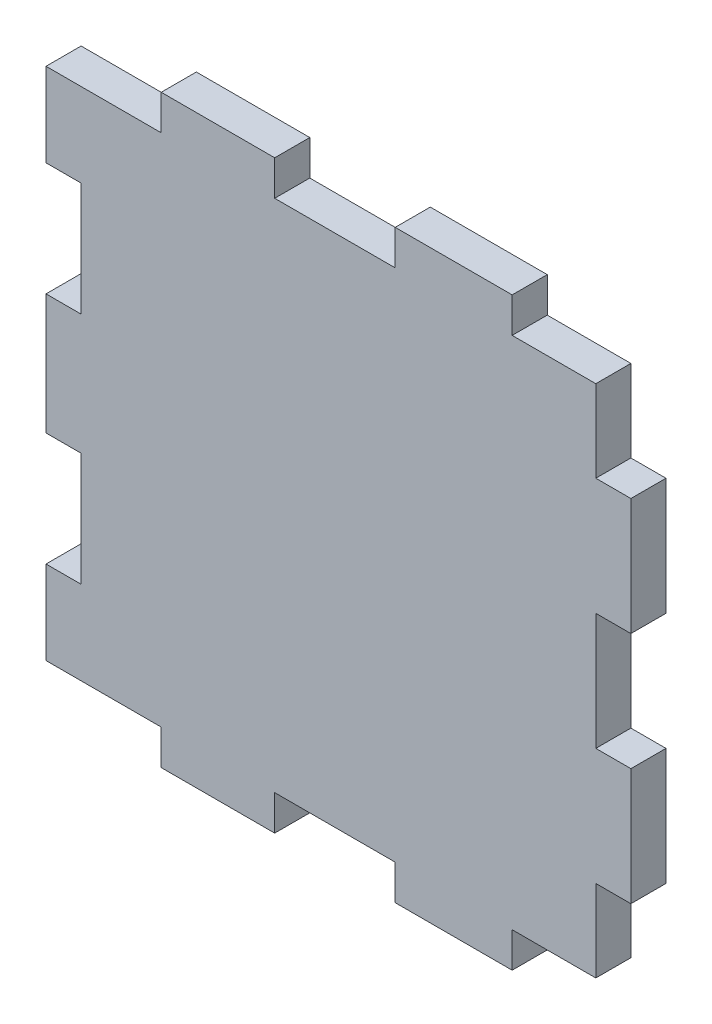
ISO-10303-21;
HEADER;
FILE_DESCRIPTION(('STEP AP214'),'2;1');
FILE_NAME('part.step','',(''),(''),'','','');
FILE_SCHEMA(('AUTOMOTIVE_DESIGN { 1 0 10303 214 1 1 1 1 }'));
ENDSEC;
DATA;
#1=APPLICATION_CONTEXT('core data for automotive mechanical design processes');
#2=APPLICATION_PROTOCOL_DEFINITION('international standard','automotive_design',2000,#1);
#3=PRODUCT_CONTEXT('',#1,'mechanical');
#4=PRODUCT('Part','Part','',(#3));
#5=PRODUCT_RELATED_PRODUCT_CATEGORY('part','',(#4));
#6=PRODUCT_DEFINITION_FORMATION('','',#4);
#7=PRODUCT_DEFINITION_CONTEXT('part definition',#1,'design');
#8=PRODUCT_DEFINITION('design','',#6,#7);
#9=PRODUCT_DEFINITION_SHAPE('','',#8);
#10=(LENGTH_UNIT() NAMED_UNIT(*) SI_UNIT(.MILLI.,.METRE.));
#11=(NAMED_UNIT(*) PLANE_ANGLE_UNIT() SI_UNIT($,.RADIAN.));
#12=(NAMED_UNIT(*) SI_UNIT($,.STERADIAN.) SOLID_ANGLE_UNIT());
#13=UNCERTAINTY_MEASURE_WITH_UNIT(LENGTH_MEASURE(1.E-05),#10,'distance_accuracy_value','');
#14=(GEOMETRIC_REPRESENTATION_CONTEXT(3) GLOBAL_UNCERTAINTY_ASSIGNED_CONTEXT((#13)) GLOBAL_UNIT_ASSIGNED_CONTEXT((#10,
#11,#12)) REPRESENTATION_CONTEXT('',''));
#15=CARTESIAN_POINT('',(0.,0.,0.));
#16=DIRECTION('',(0.,0.,1.));
#17=DIRECTION('',(1.,0.,0.));
#18=AXIS2_PLACEMENT_3D('',#15,#16,#17);
#19=CARTESIAN_POINT('',(-26.5,14.85,3.));
#20=DIRECTION('',(1.,0.,0.));
#21=DIRECTION('',(0.,0.,-1.));
#22=AXIS2_PLACEMENT_3D('',#19,#20,#21);
#23=PLANE('',#22);
#24=DIRECTION('',(0.,-1.,0.));
#25=VECTOR('',#24,1.);
#26=CARTESIAN_POINT('',(-26.5,14.85,0.));
#27=LINE('',#26,#25);
#28=CARTESIAN_POINT('',(-26.5,22.,0.));
#29=VERTEX_POINT('',#28);
#30=CARTESIAN_POINT('',(-26.5,14.85,0.));
#31=VERTEX_POINT('',#30);
#32=EDGE_CURVE('E308',#29,#31,#27,.T.);
#33=ORIENTED_EDGE('',*,*,#32,.T.);
#34=DIRECTION('',(0.,0.,-1.));
#35=VECTOR('',#34,1.);
#36=CARTESIAN_POINT('',(-26.5,14.85,3.));
#37=LINE('',#36,#35);
#38=CARTESIAN_POINT('',(-26.5,14.85,3.));
#39=VERTEX_POINT('',#38);
#40=EDGE_CURVE('E11',#39,#31,#37,.T.);
#41=ORIENTED_EDGE('',*,*,#40,.F.);
#42=DIRECTION('',(0.,-1.,0.));
#43=VECTOR('',#42,1.);
#44=CARTESIAN_POINT('',(-26.5,14.85,3.));
#45=LINE('',#44,#43);
#46=CARTESIAN_POINT('',(-26.5,22.,3.));
#47=VERTEX_POINT('',#46);
#48=EDGE_CURVE('E414',#47,#39,#45,.T.);
#49=ORIENTED_EDGE('',*,*,#48,.F.);
#50=DIRECTION('',(0.,0.,-1.));
#51=VECTOR('',#50,1.);
#52=CARTESIAN_POINT('',(-26.5,22.,3.));
#53=LINE('',#52,#51);
#54=EDGE_CURVE('E304',#47,#29,#53,.T.);
#55=ORIENTED_EDGE('',*,*,#54,.T.);
#56=EDGE_LOOP('',(#33,#41,#49,#55));
#57=FACE_BOUND('',#56,.T.);
#58=ADVANCED_FACE('F39',(#57),#23,.F.);
#59=CARTESIAN_POINT('',(-26.5,14.85,3.));
#60=DIRECTION('',(0.,1.,0.));
#61=DIRECTION('',(-1.,0.,0.));
#62=AXIS2_PLACEMENT_3D('',#59,#60,#61);
#63=PLANE('',#62);
#64=DIRECTION('',(1.,0.,0.));
#65=VECTOR('',#64,1.);
#66=CARTESIAN_POINT('',(-26.5,14.85,0.));
#67=LINE('',#66,#65);
#68=CARTESIAN_POINT('',(-23.5,14.85,0.));
#69=VERTEX_POINT('',#68);
#70=EDGE_CURVE('E312',#31,#69,#67,.T.);
#71=ORIENTED_EDGE('',*,*,#70,.T.);
#72=DIRECTION('',(0.,0.,-1.));
#73=VECTOR('',#72,1.);
#74=CARTESIAN_POINT('',(-23.5,14.85,3.));
#75=LINE('',#74,#73);
#76=CARTESIAN_POINT('',(-23.5,14.85,3.));
#77=VERTEX_POINT('',#76);
#78=EDGE_CURVE('E48',#77,#69,#75,.T.);
#79=ORIENTED_EDGE('',*,*,#78,.F.);
#80=DIRECTION('',(1.,0.,0.));
#81=VECTOR('',#80,1.);
#82=CARTESIAN_POINT('',(-26.5,14.85,3.));
#83=LINE('',#82,#81);
#84=EDGE_CURVE('E183',#39,#77,#83,.T.);
#85=ORIENTED_EDGE('',*,*,#84,.F.);
#86=ORIENTED_EDGE('',*,*,#40,.T.);
#87=EDGE_LOOP('',(#71,#79,#85,#86));
#88=FACE_BOUND('',#87,.T.);
#89=ADVANCED_FACE('F676',(#88),#63,.F.);
#90=CARTESIAN_POINT('',(-23.5,14.85,3.));
#91=DIRECTION('',(1.,0.,0.));
#92=DIRECTION('',(0.,0.,-1.));
#93=AXIS2_PLACEMENT_3D('',#90,#91,#92);
#94=PLANE('',#93);
#95=DIRECTION('',(0.,-1.,0.));
#96=VECTOR('',#95,1.);
#97=CARTESIAN_POINT('',(-23.5,14.85,0.));
#98=LINE('',#97,#96);
#99=CARTESIAN_POINT('',(-23.5,5.15,0.));
#100=VERTEX_POINT('',#99);
#101=EDGE_CURVE('E315',#69,#100,#98,.T.);
#102=ORIENTED_EDGE('',*,*,#101,.T.);
#103=DIRECTION('',(0.,0.,-1.));
#104=VECTOR('',#103,1.);
#105=CARTESIAN_POINT('',(-23.5,5.15,3.));
#106=LINE('',#105,#104);
#107=CARTESIAN_POINT('',(-23.5,5.15,3.));
#108=VERTEX_POINT('',#107);
#109=EDGE_CURVE('E537',#108,#100,#106,.T.);
#110=ORIENTED_EDGE('',*,*,#109,.F.);
#111=DIRECTION('',(0.,-1.,0.));
#112=VECTOR('',#111,1.);
#113=CARTESIAN_POINT('',(-23.5,14.85,3.));
#114=LINE('',#113,#112);
#115=EDGE_CURVE('E547',#77,#108,#114,.T.);
#116=ORIENTED_EDGE('',*,*,#115,.F.);
#117=ORIENTED_EDGE('',*,*,#78,.T.);
#118=EDGE_LOOP('',(#102,#110,#116,#117));
#119=FACE_BOUND('',#118,.T.);
#120=ADVANCED_FACE('F545',(#119),#94,.F.);
#121=CARTESIAN_POINT('',(-26.5,5.15,3.));
#122=DIRECTION('',(0.,-1.,0.));
#123=DIRECTION('',(1.,0.,0.));
#124=AXIS2_PLACEMENT_3D('',#121,#122,#123);
#125=PLANE('',#124);
#126=DIRECTION('',(-1.,0.,0.));
#127=VECTOR('',#126,1.);
#128=CARTESIAN_POINT('',(-26.5,5.15,0.));
#129=LINE('',#128,#127);
#130=CARTESIAN_POINT('',(-26.5,5.15,0.));
#131=VERTEX_POINT('',#130);
#132=EDGE_CURVE('E318',#100,#131,#129,.T.);
#133=ORIENTED_EDGE('',*,*,#132,.T.);
#134=DIRECTION('',(0.,0.,-1.));
#135=VECTOR('',#134,1.);
#136=CARTESIAN_POINT('',(-26.5,5.15,3.));
#137=LINE('',#136,#135);
#138=CARTESIAN_POINT('',(-26.5,5.15,3.));
#139=VERTEX_POINT('',#138);
#140=EDGE_CURVE('E533',#139,#131,#137,.T.);
#141=ORIENTED_EDGE('',*,*,#140,.F.);
#142=DIRECTION('',(-1.,0.,0.));
#143=VECTOR('',#142,1.);
#144=CARTESIAN_POINT('',(-26.5,5.15,3.));
#145=LINE('',#144,#143);
#146=EDGE_CURVE('E566',#108,#139,#145,.T.);
#147=ORIENTED_EDGE('',*,*,#146,.F.);
#148=ORIENTED_EDGE('',*,*,#109,.T.);
#149=EDGE_LOOP('',(#133,#141,#147,#148));
#150=FACE_BOUND('',#149,.T.);
#151=ADVANCED_FACE('F556',(#150),#125,.F.);
#152=CARTESIAN_POINT('',(-26.5,-5.15,3.));
#153=DIRECTION('',(1.,0.,0.));
#154=DIRECTION('',(0.,0.,-1.));
#155=AXIS2_PLACEMENT_3D('',#152,#153,#154);
#156=PLANE('',#155);
#157=DIRECTION('',(0.,-1.,0.));
#158=VECTOR('',#157,1.);
#159=CARTESIAN_POINT('',(-26.5,-5.15,0.));
#160=LINE('',#159,#158);
#161=CARTESIAN_POINT('',(-26.5,-5.15,0.));
#162=VERTEX_POINT('',#161);
#163=EDGE_CURVE('E321',#131,#162,#160,.T.);
#164=ORIENTED_EDGE('',*,*,#163,.T.);
#165=DIRECTION('',(0.,0.,-1.));
#166=VECTOR('',#165,1.);
#167=CARTESIAN_POINT('',(-26.5,-5.15,3.));
#168=LINE('',#167,#166);
#169=CARTESIAN_POINT('',(-26.5,-5.15,3.));
#170=VERTEX_POINT('',#169);
#171=EDGE_CURVE('E529',#170,#162,#168,.T.);
#172=ORIENTED_EDGE('',*,*,#171,.F.);
#173=DIRECTION('',(0.,-1.,0.));
#174=VECTOR('',#173,1.);
#175=CARTESIAN_POINT('',(-26.5,-5.15,3.));
#176=LINE('',#175,#174);
#177=EDGE_CURVE('E562',#139,#170,#176,.T.);
#178=ORIENTED_EDGE('',*,*,#177,.F.);
#179=ORIENTED_EDGE('',*,*,#140,.T.);
#180=EDGE_LOOP('',(#164,#172,#178,#179));
#181=FACE_BOUND('',#180,.T.);
#182=ADVANCED_FACE('F560',(#181),#156,.F.);
#183=CARTESIAN_POINT('',(-26.5,-5.15,3.));
#184=DIRECTION('',(0.,1.,0.));
#185=DIRECTION('',(-1.,0.,0.));
#186=AXIS2_PLACEMENT_3D('',#183,#184,#185);
#187=PLANE('',#186);
#188=DIRECTION('',(1.,0.,0.));
#189=VECTOR('',#188,1.);
#190=CARTESIAN_POINT('',(-26.5,-5.15,0.));
#191=LINE('',#190,#189);
#192=CARTESIAN_POINT('',(-23.5,-5.15,0.));
#193=VERTEX_POINT('',#192);
#194=EDGE_CURVE('E324',#162,#193,#191,.T.);
#195=ORIENTED_EDGE('',*,*,#194,.T.);
#196=DIRECTION('',(0.,0.,-1.));
#197=VECTOR('',#196,1.);
#198=CARTESIAN_POINT('',(-23.5,-5.15,3.));
#199=LINE('',#198,#197);
#200=CARTESIAN_POINT('',(-23.5,-5.15,3.));
#201=VERTEX_POINT('',#200);
#202=EDGE_CURVE('E525',#201,#193,#199,.T.);
#203=ORIENTED_EDGE('',*,*,#202,.F.);
#204=DIRECTION('',(1.,0.,0.));
#205=VECTOR('',#204,1.);
#206=CARTESIAN_POINT('',(-26.5,-5.15,3.));
#207=LINE('',#206,#205);
#208=EDGE_CURVE('E565',#170,#201,#207,.T.);
#209=ORIENTED_EDGE('',*,*,#208,.F.);
#210=ORIENTED_EDGE('',*,*,#171,.T.);
#211=EDGE_LOOP('',(#195,#203,#209,#210));
#212=FACE_BOUND('',#211,.T.);
#213=ADVANCED_FACE('F689',(#212),#187,.F.);
#214=CARTESIAN_POINT('',(-23.5,-14.85,3.));
#215=DIRECTION('',(1.,0.,0.));
#216=DIRECTION('',(0.,0.,-1.));
#217=AXIS2_PLACEMENT_3D('',#214,#215,#216);
#218=PLANE('',#217);
#219=DIRECTION('',(0.,-1.,0.));
#220=VECTOR('',#219,1.);
#221=CARTESIAN_POINT('',(-23.5,-14.85,0.));
#222=LINE('',#221,#220);
#223=CARTESIAN_POINT('',(-23.5,-14.85,0.));
#224=VERTEX_POINT('',#223);
#225=EDGE_CURVE('E327',#193,#224,#222,.T.);
#226=ORIENTED_EDGE('',*,*,#225,.T.);
#227=DIRECTION('',(0.,0.,-1.));
#228=VECTOR('',#227,1.);
#229=CARTESIAN_POINT('',(-23.5,-14.85,3.));
#230=LINE('',#229,#228);
#231=CARTESIAN_POINT('',(-23.5,-14.85,3.));
#232=VERTEX_POINT('',#231);
#233=EDGE_CURVE('E521',#232,#224,#230,.T.);
#234=ORIENTED_EDGE('',*,*,#233,.F.);
#235=DIRECTION('',(0.,-1.,0.));
#236=VECTOR('',#235,1.);
#237=CARTESIAN_POINT('',(-23.5,-14.85,3.));
#238=LINE('',#237,#236);
#239=EDGE_CURVE('E570',#201,#232,#238,.T.);
#240=ORIENTED_EDGE('',*,*,#239,.F.);
#241=ORIENTED_EDGE('',*,*,#202,.T.);
#242=EDGE_LOOP('',(#226,#234,#240,#241));
#243=FACE_BOUND('',#242,.T.);
#244=ADVANCED_FACE('F692',(#243),#218,.F.);
#245=CARTESIAN_POINT('',(-26.5,-14.85,3.));
#246=DIRECTION('',(0.,-1.,0.));
#247=DIRECTION('',(1.,0.,0.));
#248=AXIS2_PLACEMENT_3D('',#245,#246,#247);
#249=PLANE('',#248);
#250=DIRECTION('',(-1.,0.,0.));
#251=VECTOR('',#250,1.);
#252=CARTESIAN_POINT('',(-26.5,-14.85,0.));
#253=LINE('',#252,#251);
#254=CARTESIAN_POINT('',(-26.5,-14.85,0.));
#255=VERTEX_POINT('',#254);
#256=EDGE_CURVE('E330',#224,#255,#253,.T.);
#257=ORIENTED_EDGE('',*,*,#256,.T.);
#258=DIRECTION('',(0.,0.,-1.));
#259=VECTOR('',#258,1.);
#260=CARTESIAN_POINT('',(-26.5,-14.85,3.));
#261=LINE('',#260,#259);
#262=CARTESIAN_POINT('',(-26.5,-14.85,3.));
#263=VERTEX_POINT('',#262);
#264=EDGE_CURVE('E517',#263,#255,#261,.T.);
#265=ORIENTED_EDGE('',*,*,#264,.F.);
#266=DIRECTION('',(-1.,0.,0.));
#267=VECTOR('',#266,1.);
#268=CARTESIAN_POINT('',(-26.5,-14.85,3.));
#269=LINE('',#268,#267);
#270=EDGE_CURVE('E577',#232,#263,#269,.T.);
#271=ORIENTED_EDGE('',*,*,#270,.F.);
#272=ORIENTED_EDGE('',*,*,#233,.T.);
#273=EDGE_LOOP('',(#257,#265,#271,#272));
#274=FACE_BOUND('',#273,.T.);
#275=ADVANCED_FACE('F696',(#274),#249,.F.);
#276=CARTESIAN_POINT('',(-26.5,-14.85,3.));
#277=DIRECTION('',(1.,0.,0.));
#278=DIRECTION('',(0.,1.,0.));
#279=AXIS2_PLACEMENT_3D('',#276,#277,#278);
#280=PLANE('',#279);
#281=DIRECTION('',(0.,-1.,0.));
#282=VECTOR('',#281,1.);
#283=CARTESIAN_POINT('',(-26.5,-14.85,0.));
#284=LINE('',#283,#282);
#285=CARTESIAN_POINT('',(-26.5,-22.,0.));
#286=VERTEX_POINT('',#285);
#287=EDGE_CURVE('E333',#255,#286,#284,.T.);
#288=ORIENTED_EDGE('',*,*,#287,.T.);
#289=DIRECTION('',(0.,0.,-1.));
#290=VECTOR('',#289,1.);
#291=CARTESIAN_POINT('',(-26.5,-22.,3.));
#292=LINE('',#291,#290);
#293=CARTESIAN_POINT('',(-26.5,-22.,3.));
#294=VERTEX_POINT('',#293);
#295=EDGE_CURVE('E513',#294,#286,#292,.T.);
#296=ORIENTED_EDGE('',*,*,#295,.F.);
#297=DIRECTION('',(0.,-1.,0.));
#298=VECTOR('',#297,1.);
#299=CARTESIAN_POINT('',(-26.5,-14.85,3.));
#300=LINE('',#299,#298);
#301=EDGE_CURVE('E580',#263,#294,#300,.T.);
#302=ORIENTED_EDGE('',*,*,#301,.F.);
#303=ORIENTED_EDGE('',*,*,#264,.T.);
#304=EDGE_LOOP('',(#288,#296,#302,#303));
#305=FACE_BOUND('',#304,.T.);
#306=ADVANCED_FACE('F700',(#305),#280,.F.);
#307=CARTESIAN_POINT('',(-16.65,-22.,3.));
#308=DIRECTION('',(0.,1.,0.));
#309=DIRECTION('',(-1.,0.,0.));
#310=AXIS2_PLACEMENT_3D('',#307,#308,#309);
#311=PLANE('',#310);
#312=DIRECTION('',(1.,0.,0.));
#313=VECTOR('',#312,1.);
#314=CARTESIAN_POINT('',(-16.65,-22.,0.));
#315=LINE('',#314,#313);
#316=CARTESIAN_POINT('',(-16.65,-22.,0.));
#317=VERTEX_POINT('',#316);
#318=EDGE_CURVE('E336',#286,#317,#315,.T.);
#319=ORIENTED_EDGE('',*,*,#318,.T.);
#320=DIRECTION('',(0.,0.,-1.));
#321=VECTOR('',#320,1.);
#322=CARTESIAN_POINT('',(-16.65,-22.,3.));
#323=LINE('',#322,#321);
#324=CARTESIAN_POINT('',(-16.65,-22.,3.));
#325=VERTEX_POINT('',#324);
#326=EDGE_CURVE('E509',#325,#317,#323,.T.);
#327=ORIENTED_EDGE('',*,*,#326,.F.);
#328=DIRECTION('',(1.,0.,0.));
#329=VECTOR('',#328,1.);
#330=CARTESIAN_POINT('',(-16.65,-22.,3.));
#331=LINE('',#330,#329);
#332=EDGE_CURVE('E583',#294,#325,#331,.T.);
#333=ORIENTED_EDGE('',*,*,#332,.F.);
#334=ORIENTED_EDGE('',*,*,#295,.T.);
#335=EDGE_LOOP('',(#319,#327,#333,#334));
#336=FACE_BOUND('',#335,.T.);
#337=ADVANCED_FACE('F704',(#336),#311,.F.);
#338=CARTESIAN_POINT('',(-16.65,-25.,3.));
#339=DIRECTION('',(1.,0.,0.));
#340=DIRECTION('',(0.,0.,-1.));
#341=AXIS2_PLACEMENT_3D('',#338,#339,#340);
#342=PLANE('',#341);
#343=DIRECTION('',(0.,-1.,0.));
#344=VECTOR('',#343,1.);
#345=CARTESIAN_POINT('',(-16.65,-25.,0.));
#346=LINE('',#345,#344);
#347=CARTESIAN_POINT('',(-16.65,-25.,0.));
#348=VERTEX_POINT('',#347);
#349=EDGE_CURVE('E339',#317,#348,#346,.T.);
#350=ORIENTED_EDGE('',*,*,#349,.T.);
#351=DIRECTION('',(0.,0.,-1.));
#352=VECTOR('',#351,1.);
#353=CARTESIAN_POINT('',(-16.65,-25.,3.));
#354=LINE('',#353,#352);
#355=CARTESIAN_POINT('',(-16.65,-25.,3.));
#356=VERTEX_POINT('',#355);
#357=EDGE_CURVE('E505',#356,#348,#354,.T.);
#358=ORIENTED_EDGE('',*,*,#357,.F.);
#359=DIRECTION('',(0.,-1.,0.));
#360=VECTOR('',#359,1.);
#361=CARTESIAN_POINT('',(-16.65,-25.,3.));
#362=LINE('',#361,#360);
#363=EDGE_CURVE('E586',#325,#356,#362,.T.);
#364=ORIENTED_EDGE('',*,*,#363,.F.);
#365=ORIENTED_EDGE('',*,*,#326,.T.);
#366=EDGE_LOOP('',(#350,#358,#364,#365));
#367=FACE_BOUND('',#366,.T.);
#368=ADVANCED_FACE('F708',(#367),#342,.F.);
#369=CARTESIAN_POINT('',(-16.65,-25.,3.));
#370=DIRECTION('',(0.,1.,0.));
#371=DIRECTION('',(0.,0.,1.));
#372=AXIS2_PLACEMENT_3D('',#369,#370,#371);
#373=PLANE('',#372);
#374=DIRECTION('',(1.,0.,0.));
#375=VECTOR('',#374,1.);
#376=CARTESIAN_POINT('',(-16.65,-25.,0.));
#377=LINE('',#376,#375);
#378=CARTESIAN_POINT('',(-6.95,-25.,0.));
#379=VERTEX_POINT('',#378);
#380=EDGE_CURVE('E342',#348,#379,#377,.T.);
#381=ORIENTED_EDGE('',*,*,#380,.T.);
#382=DIRECTION('',(0.,0.,-1.));
#383=VECTOR('',#382,1.);
#384=CARTESIAN_POINT('',(-6.95,-25.,3.));
#385=LINE('',#384,#383);
#386=CARTESIAN_POINT('',(-6.95,-25.,3.));
#387=VERTEX_POINT('',#386);
#388=EDGE_CURVE('E501',#387,#379,#385,.T.);
#389=ORIENTED_EDGE('',*,*,#388,.F.);
#390=DIRECTION('',(1.,0.,0.));
#391=VECTOR('',#390,1.);
#392=CARTESIAN_POINT('',(-16.65,-25.,3.));
#393=LINE('',#392,#391);
#394=EDGE_CURVE('E589',#356,#387,#393,.T.);
#395=ORIENTED_EDGE('',*,*,#394,.F.);
#396=ORIENTED_EDGE('',*,*,#357,.T.);
#397=EDGE_LOOP('',(#381,#389,#395,#396));
#398=FACE_BOUND('',#397,.T.);
#399=ADVANCED_FACE('F712',(#398),#373,.F.);
#400=CARTESIAN_POINT('',(-6.95,-25.,3.));
#401=DIRECTION('',(-1.,0.,0.));
#402=DIRECTION('',(0.,0.,1.));
#403=AXIS2_PLACEMENT_3D('',#400,#401,#402);
#404=PLANE('',#403);
#405=DIRECTION('',(0.,1.,0.));
#406=VECTOR('',#405,1.);
#407=CARTESIAN_POINT('',(-6.95,-25.,0.));
#408=LINE('',#407,#406);
#409=CARTESIAN_POINT('',(-6.95,-22.,0.));
#410=VERTEX_POINT('',#409);
#411=EDGE_CURVE('E345',#379,#410,#408,.T.);
#412=ORIENTED_EDGE('',*,*,#411,.T.);
#413=DIRECTION('',(0.,0.,-1.));
#414=VECTOR('',#413,1.);
#415=CARTESIAN_POINT('',(-6.95,-22.,3.));
#416=LINE('',#415,#414);
#417=CARTESIAN_POINT('',(-6.95,-22.,3.));
#418=VERTEX_POINT('',#417);
#419=EDGE_CURVE('E497',#418,#410,#416,.T.);
#420=ORIENTED_EDGE('',*,*,#419,.F.);
#421=DIRECTION('',(0.,1.,0.));
#422=VECTOR('',#421,1.);
#423=CARTESIAN_POINT('',(-6.95,-25.,3.));
#424=LINE('',#423,#422);
#425=EDGE_CURVE('E592',#387,#418,#424,.T.);
#426=ORIENTED_EDGE('',*,*,#425,.F.);
#427=ORIENTED_EDGE('',*,*,#388,.T.);
#428=EDGE_LOOP('',(#412,#420,#426,#427));
#429=FACE_BOUND('',#428,.T.);
#430=ADVANCED_FACE('F716',(#429),#404,.F.);
#431=CARTESIAN_POINT('',(-6.95,-22.,3.));
#432=DIRECTION('',(0.,1.,0.));
#433=DIRECTION('',(-1.,0.,0.));
#434=AXIS2_PLACEMENT_3D('',#431,#432,#433);
#435=PLANE('',#434);
#436=DIRECTION('',(1.,0.,0.));
#437=VECTOR('',#436,1.);
#438=CARTESIAN_POINT('',(-6.95,-22.,0.));
#439=LINE('',#438,#437);
#440=CARTESIAN_POINT('',(3.35,-22.,0.));
#441=VERTEX_POINT('',#440);
#442=EDGE_CURVE('E348',#410,#441,#439,.T.);
#443=ORIENTED_EDGE('',*,*,#442,.T.);
#444=DIRECTION('',(0.,0.,-1.));
#445=VECTOR('',#444,1.);
#446=CARTESIAN_POINT('',(3.35,-22.,3.));
#447=LINE('',#446,#445);
#448=CARTESIAN_POINT('',(3.35,-22.,3.));
#449=VERTEX_POINT('',#448);
#450=EDGE_CURVE('E493',#449,#441,#447,.T.);
#451=ORIENTED_EDGE('',*,*,#450,.F.);
#452=DIRECTION('',(1.,0.,0.));
#453=VECTOR('',#452,1.);
#454=CARTESIAN_POINT('',(-6.95,-22.,3.));
#455=LINE('',#454,#453);
#456=EDGE_CURVE('E595',#418,#449,#455,.T.);
#457=ORIENTED_EDGE('',*,*,#456,.F.);
#458=ORIENTED_EDGE('',*,*,#419,.T.);
#459=EDGE_LOOP('',(#443,#451,#457,#458));
#460=FACE_BOUND('',#459,.T.);
#461=ADVANCED_FACE('F720',(#460),#435,.F.);
#462=CARTESIAN_POINT('',(3.35,-25.,3.));
#463=DIRECTION('',(1.,0.,0.));
#464=DIRECTION('',(0.,1.,0.));
#465=AXIS2_PLACEMENT_3D('',#462,#463,#464);
#466=PLANE('',#465);
#467=DIRECTION('',(0.,-1.,0.));
#468=VECTOR('',#467,1.);
#469=CARTESIAN_POINT('',(3.35,-25.,0.));
#470=LINE('',#469,#468);
#471=CARTESIAN_POINT('',(3.35,-25.,0.));
#472=VERTEX_POINT('',#471);
#473=EDGE_CURVE('E351',#441,#472,#470,.T.);
#474=ORIENTED_EDGE('',*,*,#473,.T.);
#475=DIRECTION('',(0.,0.,-1.));
#476=VECTOR('',#475,1.);
#477=CARTESIAN_POINT('',(3.35,-25.,3.));
#478=LINE('',#477,#476);
#479=CARTESIAN_POINT('',(3.35,-25.,3.));
#480=VERTEX_POINT('',#479);
#481=EDGE_CURVE('E489',#480,#472,#478,.T.);
#482=ORIENTED_EDGE('',*,*,#481,.F.);
#483=DIRECTION('',(0.,-1.,0.));
#484=VECTOR('',#483,1.);
#485=CARTESIAN_POINT('',(3.35,-25.,3.));
#486=LINE('',#485,#484);
#487=EDGE_CURVE('E598',#449,#480,#486,.T.);
#488=ORIENTED_EDGE('',*,*,#487,.F.);
#489=ORIENTED_EDGE('',*,*,#450,.T.);
#490=EDGE_LOOP('',(#474,#482,#488,#489));
#491=FACE_BOUND('',#490,.T.);
#492=ADVANCED_FACE('F724',(#491),#466,.F.);
#493=CARTESIAN_POINT('',(3.35,-25.,3.));
#494=DIRECTION('',(0.,1.,0.));
#495=DIRECTION('',(-1.,0.,0.));
#496=AXIS2_PLACEMENT_3D('',#493,#494,#495);
#497=PLANE('',#496);
#498=DIRECTION('',(1.,0.,0.));
#499=VECTOR('',#498,1.);
#500=CARTESIAN_POINT('',(3.35,-25.,0.));
#501=LINE('',#500,#499);
#502=CARTESIAN_POINT('',(13.35,-25.,0.));
#503=VERTEX_POINT('',#502);
#504=EDGE_CURVE('E354',#472,#503,#501,.T.);
#505=ORIENTED_EDGE('',*,*,#504,.T.);
#506=DIRECTION('',(0.,0.,-1.));
#507=VECTOR('',#506,1.);
#508=CARTESIAN_POINT('',(13.35,-25.,3.));
#509=LINE('',#508,#507);
#510=CARTESIAN_POINT('',(13.35,-25.,3.));
#511=VERTEX_POINT('',#510);
#512=EDGE_CURVE('E485',#511,#503,#509,.T.);
#513=ORIENTED_EDGE('',*,*,#512,.F.);
#514=DIRECTION('',(1.,0.,0.));
#515=VECTOR('',#514,1.);
#516=CARTESIAN_POINT('',(3.35,-25.,3.));
#517=LINE('',#516,#515);
#518=EDGE_CURVE('E601',#480,#511,#517,.T.);
#519=ORIENTED_EDGE('',*,*,#518,.F.);
#520=ORIENTED_EDGE('',*,*,#481,.T.);
#521=EDGE_LOOP('',(#505,#513,#519,#520));
#522=FACE_BOUND('',#521,.T.);
#523=ADVANCED_FACE('F728',(#522),#497,.F.);
#524=CARTESIAN_POINT('',(13.35,-25.,3.));
#525=DIRECTION('',(-1.,0.,0.));
#526=DIRECTION('',(0.,0.,1.));
#527=AXIS2_PLACEMENT_3D('',#524,#525,#526);
#528=PLANE('',#527);
#529=DIRECTION('',(0.,1.,0.));
#530=VECTOR('',#529,1.);
#531=CARTESIAN_POINT('',(13.35,-25.,0.));
#532=LINE('',#531,#530);
#533=CARTESIAN_POINT('',(13.35,-22.,0.));
#534=VERTEX_POINT('',#533);
#535=EDGE_CURVE('E357',#503,#534,#532,.T.);
#536=ORIENTED_EDGE('',*,*,#535,.T.);
#537=DIRECTION('',(0.,0.,-1.));
#538=VECTOR('',#537,1.);
#539=CARTESIAN_POINT('',(13.35,-22.,3.));
#540=LINE('',#539,#538);
#541=CARTESIAN_POINT('',(13.35,-22.,3.));
#542=VERTEX_POINT('',#541);
#543=EDGE_CURVE('E481',#542,#534,#540,.T.);
#544=ORIENTED_EDGE('',*,*,#543,.F.);
#545=DIRECTION('',(0.,1.,0.));
#546=VECTOR('',#545,1.);
#547=CARTESIAN_POINT('',(13.35,-25.,3.));
#548=LINE('',#547,#546);
#549=EDGE_CURVE('E604',#511,#542,#548,.T.);
#550=ORIENTED_EDGE('',*,*,#549,.F.);
#551=ORIENTED_EDGE('',*,*,#512,.T.);
#552=EDGE_LOOP('',(#536,#544,#550,#551));
#553=FACE_BOUND('',#552,.T.);
#554=ADVANCED_FACE('F732',(#553),#528,.F.);
#555=CARTESIAN_POINT('',(13.35,-22.,3.));
#556=DIRECTION('',(0.,1.,0.));
#557=DIRECTION('',(0.,0.,1.));
#558=AXIS2_PLACEMENT_3D('',#555,#556,#557);
#559=PLANE('',#558);
#560=DIRECTION('',(1.,0.,0.));
#561=VECTOR('',#560,1.);
#562=CARTESIAN_POINT('',(13.35,-22.,0.));
#563=LINE('',#562,#561);
#564=CARTESIAN_POINT('',(20.5,-22.,0.));
#565=VERTEX_POINT('',#564);
#566=EDGE_CURVE('E360',#534,#565,#563,.T.);
#567=ORIENTED_EDGE('',*,*,#566,.T.);
#568=DIRECTION('',(0.,0.,-1.));
#569=VECTOR('',#568,1.);
#570=CARTESIAN_POINT('',(20.5,-22.,3.));
#571=LINE('',#570,#569);
#572=CARTESIAN_POINT('',(20.5,-22.,3.));
#573=VERTEX_POINT('',#572);
#574=EDGE_CURVE('E477',#573,#565,#571,.T.);
#575=ORIENTED_EDGE('',*,*,#574,.F.);
#576=DIRECTION('',(1.,0.,0.));
#577=VECTOR('',#576,1.);
#578=CARTESIAN_POINT('',(13.35,-22.,3.));
#579=LINE('',#578,#577);
#580=EDGE_CURVE('E607',#542,#573,#579,.T.);
#581=ORIENTED_EDGE('',*,*,#580,.F.);
#582=ORIENTED_EDGE('',*,*,#543,.T.);
#583=EDGE_LOOP('',(#567,#575,#581,#582));
#584=FACE_BOUND('',#583,.T.);
#585=ADVANCED_FACE('F736',(#584),#559,.F.);
#586=CARTESIAN_POINT('',(20.5,-15.,3.));
#587=DIRECTION('',(-1.,0.,0.));
#588=DIRECTION('',(0.,-1.,0.));
#589=AXIS2_PLACEMENT_3D('',#586,#587,#588);
#590=PLANE('',#589);
#591=DIRECTION('',(0.,1.,0.));
#592=VECTOR('',#591,1.);
#593=CARTESIAN_POINT('',(20.5,-15.,0.));
#594=LINE('',#593,#592);
#595=CARTESIAN_POINT('',(20.5,-15.,0.));
#596=VERTEX_POINT('',#595);
#597=EDGE_CURVE('E363',#565,#596,#594,.T.);
#598=ORIENTED_EDGE('',*,*,#597,.T.);
#599=DIRECTION('',(0.,0.,-1.));
#600=VECTOR('',#599,1.);
#601=CARTESIAN_POINT('',(20.5,-15.,3.));
#602=LINE('',#601,#600);
#603=CARTESIAN_POINT('',(20.5,-15.,3.));
#604=VERTEX_POINT('',#603);
#605=EDGE_CURVE('E473',#604,#596,#602,.T.);
#606=ORIENTED_EDGE('',*,*,#605,.F.);
#607=DIRECTION('',(0.,1.,0.));
#608=VECTOR('',#607,1.);
#609=CARTESIAN_POINT('',(20.5,-15.,3.));
#610=LINE('',#609,#608);
#611=EDGE_CURVE('E610',#573,#604,#610,.T.);
#612=ORIENTED_EDGE('',*,*,#611,.F.);
#613=ORIENTED_EDGE('',*,*,#574,.T.);
#614=EDGE_LOOP('',(#598,#606,#612,#613));
#615=FACE_BOUND('',#614,.T.);
#616=ADVANCED_FACE('F740',(#615),#590,.F.);
#617=CARTESIAN_POINT('',(23.5,-15.,3.));
#618=DIRECTION('',(0.,1.,0.));
#619=DIRECTION('',(-1.,0.,0.));
#620=AXIS2_PLACEMENT_3D('',#617,#618,#619);
#621=PLANE('',#620);
#622=DIRECTION('',(1.,0.,0.));
#623=VECTOR('',#622,1.);
#624=CARTESIAN_POINT('',(23.5,-15.,0.));
#625=LINE('',#624,#623);
#626=CARTESIAN_POINT('',(23.5,-15.,0.));
#627=VERTEX_POINT('',#626);
#628=EDGE_CURVE('E366',#596,#627,#625,.T.);
#629=ORIENTED_EDGE('',*,*,#628,.T.);
#630=DIRECTION('',(0.,0.,-1.));
#631=VECTOR('',#630,1.);
#632=CARTESIAN_POINT('',(23.5,-15.,3.));
#633=LINE('',#632,#631);
#634=CARTESIAN_POINT('',(23.5,-15.,3.));
#635=VERTEX_POINT('',#634);
#636=EDGE_CURVE('E469',#635,#627,#633,.T.);
#637=ORIENTED_EDGE('',*,*,#636,.F.);
#638=DIRECTION('',(1.,0.,0.));
#639=VECTOR('',#638,1.);
#640=CARTESIAN_POINT('',(23.5,-15.,3.));
#641=LINE('',#640,#639);
#642=EDGE_CURVE('E613',#604,#635,#641,.T.);
#643=ORIENTED_EDGE('',*,*,#642,.F.);
#644=ORIENTED_EDGE('',*,*,#605,.T.);
#645=EDGE_LOOP('',(#629,#637,#643,#644));
#646=FACE_BOUND('',#645,.T.);
#647=ADVANCED_FACE('F744',(#646),#621,.F.);
#648=CARTESIAN_POINT('',(23.5,-15.,3.));
#649=DIRECTION('',(-1.,0.,0.));
#650=DIRECTION('',(0.,0.,1.));
#651=AXIS2_PLACEMENT_3D('',#648,#649,#650);
#652=PLANE('',#651);
#653=DIRECTION('',(0.,1.,0.));
#654=VECTOR('',#653,1.);
#655=CARTESIAN_POINT('',(23.5,-15.,0.));
#656=LINE('',#655,#654);
#657=CARTESIAN_POINT('',(23.5,-5.,0.));
#658=VERTEX_POINT('',#657);
#659=EDGE_CURVE('E369',#627,#658,#656,.T.);
#660=ORIENTED_EDGE('',*,*,#659,.T.);
#661=DIRECTION('',(0.,0.,-1.));
#662=VECTOR('',#661,1.);
#663=CARTESIAN_POINT('',(23.5,-5.,3.));
#664=LINE('',#663,#662);
#665=CARTESIAN_POINT('',(23.5,-5.,3.));
#666=VERTEX_POINT('',#665);
#667=EDGE_CURVE('E465',#666,#658,#664,.T.);
#668=ORIENTED_EDGE('',*,*,#667,.F.);
#669=DIRECTION('',(0.,1.,0.));
#670=VECTOR('',#669,1.);
#671=CARTESIAN_POINT('',(23.5,-15.,3.));
#672=LINE('',#671,#670);
#673=EDGE_CURVE('E616',#635,#666,#672,.T.);
#674=ORIENTED_EDGE('',*,*,#673,.F.);
#675=ORIENTED_EDGE('',*,*,#636,.T.);
#676=EDGE_LOOP('',(#660,#668,#674,#675));
#677=FACE_BOUND('',#676,.T.);
#678=ADVANCED_FACE('F748',(#677),#652,.F.);
#679=CARTESIAN_POINT('',(23.5,-5.,3.));
#680=DIRECTION('',(0.,-1.,0.));
#681=DIRECTION('',(1.,0.,0.));
#682=AXIS2_PLACEMENT_3D('',#679,#680,#681);
#683=PLANE('',#682);
#684=DIRECTION('',(-1.,0.,0.));
#685=VECTOR('',#684,1.);
#686=CARTESIAN_POINT('',(23.5,-5.,0.));
#687=LINE('',#686,#685);
#688=CARTESIAN_POINT('',(20.5,-5.,0.));
#689=VERTEX_POINT('',#688);
#690=EDGE_CURVE('E372',#658,#689,#687,.T.);
#691=ORIENTED_EDGE('',*,*,#690,.T.);
#692=DIRECTION('',(0.,0.,-1.));
#693=VECTOR('',#692,1.);
#694=CARTESIAN_POINT('',(20.5,-5.,3.));
#695=LINE('',#694,#693);
#696=CARTESIAN_POINT('',(20.5,-5.,3.));
#697=VERTEX_POINT('',#696);
#698=EDGE_CURVE('E461',#697,#689,#695,.T.);
#699=ORIENTED_EDGE('',*,*,#698,.F.);
#700=DIRECTION('',(-1.,0.,0.));
#701=VECTOR('',#700,1.);
#702=CARTESIAN_POINT('',(23.5,-5.,3.));
#703=LINE('',#702,#701);
#704=EDGE_CURVE('E619',#666,#697,#703,.T.);
#705=ORIENTED_EDGE('',*,*,#704,.F.);
#706=ORIENTED_EDGE('',*,*,#667,.T.);
#707=EDGE_LOOP('',(#691,#699,#705,#706));
#708=FACE_BOUND('',#707,.T.);
#709=ADVANCED_FACE('F752',(#708),#683,.F.);
#710=CARTESIAN_POINT('',(20.5,5.,3.));
#711=DIRECTION('',(-1.,0.,0.));
#712=DIRECTION('',(0.,0.,1.));
#713=AXIS2_PLACEMENT_3D('',#710,#711,#712);
#714=PLANE('',#713);
#715=DIRECTION('',(0.,1.,0.));
#716=VECTOR('',#715,1.);
#717=CARTESIAN_POINT('',(20.5,5.,0.));
#718=LINE('',#717,#716);
#719=CARTESIAN_POINT('',(20.5,5.,0.));
#720=VERTEX_POINT('',#719);
#721=EDGE_CURVE('E375',#689,#720,#718,.T.);
#722=ORIENTED_EDGE('',*,*,#721,.T.);
#723=DIRECTION('',(0.,0.,-1.));
#724=VECTOR('',#723,1.);
#725=CARTESIAN_POINT('',(20.5,5.,3.));
#726=LINE('',#725,#724);
#727=CARTESIAN_POINT('',(20.5,5.,3.));
#728=VERTEX_POINT('',#727);
#729=EDGE_CURVE('E457',#728,#720,#726,.T.);
#730=ORIENTED_EDGE('',*,*,#729,.F.);
#731=DIRECTION('',(0.,1.,0.));
#732=VECTOR('',#731,1.);
#733=CARTESIAN_POINT('',(20.5,5.,3.));
#734=LINE('',#733,#732);
#735=EDGE_CURVE('E622',#697,#728,#734,.T.);
#736=ORIENTED_EDGE('',*,*,#735,.F.);
#737=ORIENTED_EDGE('',*,*,#698,.T.);
#738=EDGE_LOOP('',(#722,#730,#736,#737));
#739=FACE_BOUND('',#738,.T.);
#740=ADVANCED_FACE('F756',(#739),#714,.F.);
#741=CARTESIAN_POINT('',(23.5,5.,3.));
#742=DIRECTION('',(0.,1.,0.));
#743=DIRECTION('',(-1.,0.,0.));
#744=AXIS2_PLACEMENT_3D('',#741,#742,#743);
#745=PLANE('',#744);
#746=DIRECTION('',(1.,0.,0.));
#747=VECTOR('',#746,1.);
#748=CARTESIAN_POINT('',(23.5,5.,0.));
#749=LINE('',#748,#747);
#750=CARTESIAN_POINT('',(23.5,5.,0.));
#751=VERTEX_POINT('',#750);
#752=EDGE_CURVE('E378',#720,#751,#749,.T.);
#753=ORIENTED_EDGE('',*,*,#752,.T.);
#754=DIRECTION('',(0.,0.,-1.));
#755=VECTOR('',#754,1.);
#756=CARTESIAN_POINT('',(23.5,5.,3.));
#757=LINE('',#756,#755);
#758=CARTESIAN_POINT('',(23.5,5.,3.));
#759=VERTEX_POINT('',#758);
#760=EDGE_CURVE('E453',#759,#751,#757,.T.);
#761=ORIENTED_EDGE('',*,*,#760,.F.);
#762=DIRECTION('',(1.,0.,0.));
#763=VECTOR('',#762,1.);
#764=CARTESIAN_POINT('',(23.5,5.,3.));
#765=LINE('',#764,#763);
#766=EDGE_CURVE('E625',#728,#759,#765,.T.);
#767=ORIENTED_EDGE('',*,*,#766,.F.);
#768=ORIENTED_EDGE('',*,*,#729,.T.);
#769=EDGE_LOOP('',(#753,#761,#767,#768));
#770=FACE_BOUND('',#769,.T.);
#771=ADVANCED_FACE('F760',(#770),#745,.F.);
#772=CARTESIAN_POINT('',(23.5,15.,3.));
#773=DIRECTION('',(-1.,0.,0.));
#774=DIRECTION('',(0.,0.,1.));
#775=AXIS2_PLACEMENT_3D('',#772,#773,#774);
#776=PLANE('',#775);
#777=DIRECTION('',(0.,1.,0.));
#778=VECTOR('',#777,1.);
#779=CARTESIAN_POINT('',(23.5,15.,0.));
#780=LINE('',#779,#778);
#781=CARTESIAN_POINT('',(23.5,15.,0.));
#782=VERTEX_POINT('',#781);
#783=EDGE_CURVE('E381',#751,#782,#780,.T.);
#784=ORIENTED_EDGE('',*,*,#783,.T.);
#785=DIRECTION('',(0.,0.,-1.));
#786=VECTOR('',#785,1.);
#787=CARTESIAN_POINT('',(23.5,15.,3.));
#788=LINE('',#787,#786);
#789=CARTESIAN_POINT('',(23.5,15.,3.));
#790=VERTEX_POINT('',#789);
#791=EDGE_CURVE('E449',#790,#782,#788,.T.);
#792=ORIENTED_EDGE('',*,*,#791,.F.);
#793=DIRECTION('',(0.,1.,0.));
#794=VECTOR('',#793,1.);
#795=CARTESIAN_POINT('',(23.5,15.,3.));
#796=LINE('',#795,#794);
#797=EDGE_CURVE('E628',#759,#790,#796,.T.);
#798=ORIENTED_EDGE('',*,*,#797,.F.);
#799=ORIENTED_EDGE('',*,*,#760,.T.);
#800=EDGE_LOOP('',(#784,#792,#798,#799));
#801=FACE_BOUND('',#800,.T.);
#802=ADVANCED_FACE('F764',(#801),#776,.F.);
#803=CARTESIAN_POINT('',(23.5,15.,3.));
#804=DIRECTION('',(0.,-1.,0.));
#805=DIRECTION('',(0.,0.,-1.));
#806=AXIS2_PLACEMENT_3D('',#803,#804,#805);
#807=PLANE('',#806);
#808=DIRECTION('',(-1.,0.,0.));
#809=VECTOR('',#808,1.);
#810=CARTESIAN_POINT('',(23.5,15.,0.));
#811=LINE('',#810,#809);
#812=CARTESIAN_POINT('',(20.5,15.,0.));
#813=VERTEX_POINT('',#812);
#814=EDGE_CURVE('E384',#782,#813,#811,.T.);
#815=ORIENTED_EDGE('',*,*,#814,.T.);
#816=DIRECTION('',(0.,0.,-1.));
#817=VECTOR('',#816,1.);
#818=CARTESIAN_POINT('',(20.5,15.,3.));
#819=LINE('',#818,#817);
#820=CARTESIAN_POINT('',(20.5,15.,3.));
#821=VERTEX_POINT('',#820);
#822=EDGE_CURVE('E445',#821,#813,#819,.T.);
#823=ORIENTED_EDGE('',*,*,#822,.F.);
#824=DIRECTION('',(-1.,0.,0.));
#825=VECTOR('',#824,1.);
#826=CARTESIAN_POINT('',(23.5,15.,3.));
#827=LINE('',#826,#825);
#828=EDGE_CURVE('E631',#790,#821,#827,.T.);
#829=ORIENTED_EDGE('',*,*,#828,.F.);
#830=ORIENTED_EDGE('',*,*,#791,.T.);
#831=EDGE_LOOP('',(#815,#823,#829,#830));
#832=FACE_BOUND('',#831,.T.);
#833=ADVANCED_FACE('F768',(#832),#807,.F.);
#834=CARTESIAN_POINT('',(20.5,15.,3.));
#835=DIRECTION('',(-1.,0.,0.));
#836=DIRECTION('',(0.,-1.,0.));
#837=AXIS2_PLACEMENT_3D('',#834,#835,#836);
#838=PLANE('',#837);
#839=DIRECTION('',(0.,1.,0.));
#840=VECTOR('',#839,1.);
#841=CARTESIAN_POINT('',(20.5,15.,0.));
#842=LINE('',#841,#840);
#843=CARTESIAN_POINT('',(20.5,22.,0.));
#844=VERTEX_POINT('',#843);
#845=EDGE_CURVE('E387',#813,#844,#842,.T.);
#846=ORIENTED_EDGE('',*,*,#845,.T.);
#847=DIRECTION('',(0.,0.,-1.));
#848=VECTOR('',#847,1.);
#849=CARTESIAN_POINT('',(20.5,22.,3.));
#850=LINE('',#849,#848);
#851=CARTESIAN_POINT('',(20.5,22.,3.));
#852=VERTEX_POINT('',#851);
#853=EDGE_CURVE('E441',#852,#844,#850,.T.);
#854=ORIENTED_EDGE('',*,*,#853,.F.);
#855=DIRECTION('',(0.,1.,0.));
#856=VECTOR('',#855,1.);
#857=CARTESIAN_POINT('',(20.5,15.,3.));
#858=LINE('',#857,#856);
#859=EDGE_CURVE('E634',#821,#852,#858,.T.);
#860=ORIENTED_EDGE('',*,*,#859,.F.);
#861=ORIENTED_EDGE('',*,*,#822,.T.);
#862=EDGE_LOOP('',(#846,#854,#860,#861));
#863=FACE_BOUND('',#862,.T.);
#864=ADVANCED_FACE('F772',(#863),#838,.F.);
#865=CARTESIAN_POINT('',(13.35,22.,3.));
#866=DIRECTION('',(0.,-1.,0.));
#867=DIRECTION('',(0.,0.,-1.));
#868=AXIS2_PLACEMENT_3D('',#865,#866,#867);
#869=PLANE('',#868);
#870=DIRECTION('',(-1.,0.,0.));
#871=VECTOR('',#870,1.);
#872=CARTESIAN_POINT('',(13.35,22.,0.));
#873=LINE('',#872,#871);
#874=CARTESIAN_POINT('',(13.35,22.,0.));
#875=VERTEX_POINT('',#874);
#876=EDGE_CURVE('E390',#844,#875,#873,.T.);
#877=ORIENTED_EDGE('',*,*,#876,.T.);
#878=DIRECTION('',(0.,0.,-1.));
#879=VECTOR('',#878,1.);
#880=CARTESIAN_POINT('',(13.35,22.,3.));
#881=LINE('',#880,#879);
#882=CARTESIAN_POINT('',(13.35,22.,3.));
#883=VERTEX_POINT('',#882);
#884=EDGE_CURVE('E437',#883,#875,#881,.T.);
#885=ORIENTED_EDGE('',*,*,#884,.F.);
#886=DIRECTION('',(-1.,0.,0.));
#887=VECTOR('',#886,1.);
#888=CARTESIAN_POINT('',(13.35,22.,3.));
#889=LINE('',#888,#887);
#890=EDGE_CURVE('E637',#852,#883,#889,.T.);
#891=ORIENTED_EDGE('',*,*,#890,.F.);
#892=ORIENTED_EDGE('',*,*,#853,.T.);
#893=EDGE_LOOP('',(#877,#885,#891,#892));
#894=FACE_BOUND('',#893,.T.);
#895=ADVANCED_FACE('F776',(#894),#869,.F.);
#896=CARTESIAN_POINT('',(13.35,25.,3.));
#897=DIRECTION('',(-1.,0.,0.));
#898=DIRECTION('',(0.,0.,1.));
#899=AXIS2_PLACEMENT_3D('',#896,#897,#898);
#900=PLANE('',#899);
#901=DIRECTION('',(0.,1.,0.));
#902=VECTOR('',#901,1.);
#903=CARTESIAN_POINT('',(13.35,25.,0.));
#904=LINE('',#903,#902);
#905=CARTESIAN_POINT('',(13.35,25.,0.));
#906=VERTEX_POINT('',#905);
#907=EDGE_CURVE('E393',#875,#906,#904,.T.);
#908=ORIENTED_EDGE('',*,*,#907,.T.);
#909=DIRECTION('',(0.,0.,-1.));
#910=VECTOR('',#909,1.);
#911=CARTESIAN_POINT('',(13.35,25.,3.));
#912=LINE('',#911,#910);
#913=CARTESIAN_POINT('',(13.35,25.,3.));
#914=VERTEX_POINT('',#913);
#915=EDGE_CURVE('E433',#914,#906,#912,.T.);
#916=ORIENTED_EDGE('',*,*,#915,.F.);
#917=DIRECTION('',(0.,1.,0.));
#918=VECTOR('',#917,1.);
#919=CARTESIAN_POINT('',(13.35,25.,3.));
#920=LINE('',#919,#918);
#921=EDGE_CURVE('E640',#883,#914,#920,.T.);
#922=ORIENTED_EDGE('',*,*,#921,.F.);
#923=ORIENTED_EDGE('',*,*,#884,.T.);
#924=EDGE_LOOP('',(#908,#916,#922,#923));
#925=FACE_BOUND('',#924,.T.);
#926=ADVANCED_FACE('F780',(#925),#900,.F.);
#927=CARTESIAN_POINT('',(3.35,25.,3.));
#928=DIRECTION('',(0.,-1.,0.));
#929=DIRECTION('',(1.,0.,0.));
#930=AXIS2_PLACEMENT_3D('',#927,#928,#929);
#931=PLANE('',#930);
#932=DIRECTION('',(-1.,0.,0.));
#933=VECTOR('',#932,1.);
#934=CARTESIAN_POINT('',(3.35,25.,0.));
#935=LINE('',#934,#933);
#936=CARTESIAN_POINT('',(3.35,25.,0.));
#937=VERTEX_POINT('',#936);
#938=EDGE_CURVE('E396',#906,#937,#935,.T.);
#939=ORIENTED_EDGE('',*,*,#938,.T.);
#940=DIRECTION('',(0.,0.,-1.));
#941=VECTOR('',#940,1.);
#942=CARTESIAN_POINT('',(3.35,25.,3.));
#943=LINE('',#942,#941);
#944=CARTESIAN_POINT('',(3.35,25.,3.));
#945=VERTEX_POINT('',#944);
#946=EDGE_CURVE('E429',#945,#937,#943,.T.);
#947=ORIENTED_EDGE('',*,*,#946,.F.);
#948=DIRECTION('',(-1.,0.,0.));
#949=VECTOR('',#948,1.);
#950=CARTESIAN_POINT('',(3.35,25.,3.));
#951=LINE('',#950,#949);
#952=EDGE_CURVE('E643',#914,#945,#951,.T.);
#953=ORIENTED_EDGE('',*,*,#952,.F.);
#954=ORIENTED_EDGE('',*,*,#915,.T.);
#955=EDGE_LOOP('',(#939,#947,#953,#954));
#956=FACE_BOUND('',#955,.T.);
#957=ADVANCED_FACE('F784',(#956),#931,.F.);
#958=CARTESIAN_POINT('',(3.35,25.,3.));
#959=DIRECTION('',(1.,0.,0.));
#960=DIRECTION('',(0.,1.,0.));
#961=AXIS2_PLACEMENT_3D('',#958,#959,#960);
#962=PLANE('',#961);
#963=DIRECTION('',(0.,-1.,0.));
#964=VECTOR('',#963,1.);
#965=CARTESIAN_POINT('',(3.35,25.,0.));
#966=LINE('',#965,#964);
#967=CARTESIAN_POINT('',(3.35,22.,0.));
#968=VERTEX_POINT('',#967);
#969=EDGE_CURVE('E399',#937,#968,#966,.T.);
#970=ORIENTED_EDGE('',*,*,#969,.T.);
#971=DIRECTION('',(0.,0.,-1.));
#972=VECTOR('',#971,1.);
#973=CARTESIAN_POINT('',(3.35,22.,3.));
#974=LINE('',#973,#972);
#975=CARTESIAN_POINT('',(3.35,22.,3.));
#976=VERTEX_POINT('',#975);
#977=EDGE_CURVE('E425',#976,#968,#974,.T.);
#978=ORIENTED_EDGE('',*,*,#977,.F.);
#979=DIRECTION('',(0.,-1.,0.));
#980=VECTOR('',#979,1.);
#981=CARTESIAN_POINT('',(3.35,25.,3.));
#982=LINE('',#981,#980);
#983=EDGE_CURVE('E646',#945,#976,#982,.T.);
#984=ORIENTED_EDGE('',*,*,#983,.F.);
#985=ORIENTED_EDGE('',*,*,#946,.T.);
#986=EDGE_LOOP('',(#970,#978,#984,#985));
#987=FACE_BOUND('',#986,.T.);
#988=ADVANCED_FACE('F788',(#987),#962,.F.);
#989=CARTESIAN_POINT('',(-6.95,22.,3.));
#990=DIRECTION('',(0.,-1.,0.));
#991=DIRECTION('',(1.,0.,0.));
#992=AXIS2_PLACEMENT_3D('',#989,#990,#991);
#993=PLANE('',#992);
#994=DIRECTION('',(-1.,0.,0.));
#995=VECTOR('',#994,1.);
#996=CARTESIAN_POINT('',(-6.95,22.,0.));
#997=LINE('',#996,#995);
#998=CARTESIAN_POINT('',(-6.95,22.,0.));
#999=VERTEX_POINT('',#998);
#1000=EDGE_CURVE('E402',#968,#999,#997,.T.);
#1001=ORIENTED_EDGE('',*,*,#1000,.T.);
#1002=DIRECTION('',(0.,0.,-1.));
#1003=VECTOR('',#1002,1.);
#1004=CARTESIAN_POINT('',(-6.95,22.,3.));
#1005=LINE('',#1004,#1003);
#1006=CARTESIAN_POINT('',(-6.95,22.,3.));
#1007=VERTEX_POINT('',#1006);
#1008=EDGE_CURVE('E421',#1007,#999,#1005,.T.);
#1009=ORIENTED_EDGE('',*,*,#1008,.F.);
#1010=DIRECTION('',(-1.,0.,0.));
#1011=VECTOR('',#1010,1.);
#1012=CARTESIAN_POINT('',(-6.95,22.,3.));
#1013=LINE('',#1012,#1011);
#1014=EDGE_CURVE('E649',#976,#1007,#1013,.T.);
#1015=ORIENTED_EDGE('',*,*,#1014,.F.);
#1016=ORIENTED_EDGE('',*,*,#977,.T.);
#1017=EDGE_LOOP('',(#1001,#1009,#1015,#1016));
#1018=FACE_BOUND('',#1017,.T.);
#1019=ADVANCED_FACE('F657',(#1018),#993,.F.);
#1020=CARTESIAN_POINT('',(-6.95,25.,3.));
#1021=DIRECTION('',(-1.,0.,0.));
#1022=DIRECTION('',(0.,0.,1.));
#1023=AXIS2_PLACEMENT_3D('',#1020,#1021,#1022);
#1024=PLANE('',#1023);
#1025=DIRECTION('',(0.,1.,0.));
#1026=VECTOR('',#1025,1.);
#1027=CARTESIAN_POINT('',(-6.95,25.,0.));
#1028=LINE('',#1027,#1026);
#1029=CARTESIAN_POINT('',(-6.95,25.,0.));
#1030=VERTEX_POINT('',#1029);
#1031=EDGE_CURVE('E405',#999,#1030,#1028,.T.);
#1032=ORIENTED_EDGE('',*,*,#1031,.T.);
#1033=DIRECTION('',(0.,0.,-1.));
#1034=VECTOR('',#1033,1.);
#1035=CARTESIAN_POINT('',(-6.95,25.,3.));
#1036=LINE('',#1035,#1034);
#1037=CARTESIAN_POINT('',(-6.95,25.,3.));
#1038=VERTEX_POINT('',#1037);
#1039=EDGE_CURVE('E297',#1038,#1030,#1036,.T.);
#1040=ORIENTED_EDGE('',*,*,#1039,.F.);
#1041=DIRECTION('',(0.,1.,0.));
#1042=VECTOR('',#1041,1.);
#1043=CARTESIAN_POINT('',(-6.95,25.,3.));
#1044=LINE('',#1043,#1042);
#1045=EDGE_CURVE('E286',#1007,#1038,#1044,.T.);
#1046=ORIENTED_EDGE('',*,*,#1045,.F.);
#1047=ORIENTED_EDGE('',*,*,#1008,.T.);
#1048=EDGE_LOOP('',(#1032,#1040,#1046,#1047));
#1049=FACE_BOUND('',#1048,.T.);
#1050=ADVANCED_FACE('F661',(#1049),#1024,.F.);
#1051=CARTESIAN_POINT('',(-16.65,25.,3.));
#1052=DIRECTION('',(0.,-1.,0.));
#1053=DIRECTION('',(0.,0.,-1.));
#1054=AXIS2_PLACEMENT_3D('',#1051,#1052,#1053);
#1055=PLANE('',#1054);
#1056=DIRECTION('',(-1.,0.,0.));
#1057=VECTOR('',#1056,1.);
#1058=CARTESIAN_POINT('',(-16.65,25.,0.));
#1059=LINE('',#1058,#1057);
#1060=CARTESIAN_POINT('',(-16.65,25.,0.));
#1061=VERTEX_POINT('',#1060);
#1062=EDGE_CURVE('E295',#1030,#1061,#1059,.T.);
#1063=ORIENTED_EDGE('',*,*,#1062,.T.);
#1064=DIRECTION('',(0.,0.,-1.));
#1065=VECTOR('',#1064,1.);
#1066=CARTESIAN_POINT('',(-16.65,25.,3.));
#1067=LINE('',#1066,#1065);
#1068=CARTESIAN_POINT('',(-16.65,25.,3.));
#1069=VERTEX_POINT('',#1068);
#1070=EDGE_CURVE('E292',#1069,#1061,#1067,.T.);
#1071=ORIENTED_EDGE('',*,*,#1070,.F.);
#1072=DIRECTION('',(-1.,0.,0.));
#1073=VECTOR('',#1072,1.);
#1074=CARTESIAN_POINT('',(-16.65,25.,3.));
#1075=LINE('',#1074,#1073);
#1076=EDGE_CURVE('E280',#1038,#1069,#1075,.T.);
#1077=ORIENTED_EDGE('',*,*,#1076,.F.);
#1078=ORIENTED_EDGE('',*,*,#1039,.T.);
#1079=EDGE_LOOP('',(#1063,#1071,#1077,#1078));
#1080=FACE_BOUND('',#1079,.T.);
#1081=ADVANCED_FACE('F293',(#1080),#1055,.F.);
#1082=CARTESIAN_POINT('',(-16.65,25.,3.));
#1083=DIRECTION('',(1.,0.,0.));
#1084=DIRECTION('',(0.,0.,-1.));
#1085=AXIS2_PLACEMENT_3D('',#1082,#1083,#1084);
#1086=PLANE('',#1085);
#1087=DIRECTION('',(0.,-1.,0.));
#1088=VECTOR('',#1087,1.);
#1089=CARTESIAN_POINT('',(-16.65,25.,0.));
#1090=LINE('',#1089,#1088);
#1091=CARTESIAN_POINT('',(-16.65,22.,0.));
#1092=VERTEX_POINT('',#1091);
#1093=EDGE_CURVE('E169',#1061,#1092,#1090,.T.);
#1094=ORIENTED_EDGE('',*,*,#1093,.T.);
#1095=DIRECTION('',(0.,0.,-1.));
#1096=VECTOR('',#1095,1.);
#1097=CARTESIAN_POINT('',(-16.65,22.,3.));
#1098=LINE('',#1097,#1096);
#1099=CARTESIAN_POINT('',(-16.65,22.,3.));
#1100=VERTEX_POINT('',#1099);
#1101=EDGE_CURVE('E298',#1100,#1092,#1098,.T.);
#1102=ORIENTED_EDGE('',*,*,#1101,.F.);
#1103=DIRECTION('',(0.,-1.,0.));
#1104=VECTOR('',#1103,1.);
#1105=CARTESIAN_POINT('',(-16.65,25.,3.));
#1106=LINE('',#1105,#1104);
#1107=EDGE_CURVE('E284',#1069,#1100,#1106,.T.);
#1108=ORIENTED_EDGE('',*,*,#1107,.F.);
#1109=ORIENTED_EDGE('',*,*,#1070,.T.);
#1110=EDGE_LOOP('',(#1094,#1102,#1108,#1109));
#1111=FACE_BOUND('',#1110,.T.);
#1112=ADVANCED_FACE('F300',(#1111),#1086,.F.);
#1113=CARTESIAN_POINT('',(-16.65,22.,3.));
#1114=DIRECTION('',(0.,-1.,0.));
#1115=DIRECTION('',(0.,0.,-1.));
#1116=AXIS2_PLACEMENT_3D('',#1113,#1114,#1115);
#1117=PLANE('',#1116);
#1118=DIRECTION('',(-1.,0.,0.));
#1119=VECTOR('',#1118,1.);
#1120=CARTESIAN_POINT('',(-16.65,22.,0.));
#1121=LINE('',#1120,#1119);
#1122=EDGE_CURVE('E175',#1092,#29,#1121,.T.);
#1123=ORIENTED_EDGE('',*,*,#1122,.T.);
#1124=ORIENTED_EDGE('',*,*,#54,.F.);
#1125=DIRECTION('',(-1.,0.,0.));
#1126=VECTOR('',#1125,1.);
#1127=CARTESIAN_POINT('',(-16.65,22.,3.));
#1128=LINE('',#1127,#1126);
#1129=EDGE_CURVE('E56',#1100,#47,#1128,.T.);
#1130=ORIENTED_EDGE('',*,*,#1129,.F.);
#1131=ORIENTED_EDGE('',*,*,#1101,.T.);
#1132=EDGE_LOOP('',(#1123,#1124,#1130,#1131));
#1133=FACE_BOUND('',#1132,.T.);
#1134=ADVANCED_FACE('F665',(#1133),#1117,.F.);
#1135=CARTESIAN_POINT('',(0.,0.,3.));
#1136=DIRECTION('',(0.,0.,1.));
#1137=DIRECTION('',(1.,0.,0.));
#1138=AXIS2_PLACEMENT_3D('',#1135,#1136,#1137);
#1139=PLANE('',#1138);
#1140=ORIENTED_EDGE('',*,*,#48,.T.);
#1141=ORIENTED_EDGE('',*,*,#84,.T.);
#1142=ORIENTED_EDGE('',*,*,#115,.T.);
#1143=ORIENTED_EDGE('',*,*,#146,.T.);
#1144=ORIENTED_EDGE('',*,*,#177,.T.);
#1145=ORIENTED_EDGE('',*,*,#208,.T.);
#1146=ORIENTED_EDGE('',*,*,#239,.T.);
#1147=ORIENTED_EDGE('',*,*,#270,.T.);
#1148=ORIENTED_EDGE('',*,*,#301,.T.);
#1149=ORIENTED_EDGE('',*,*,#332,.T.);
#1150=ORIENTED_EDGE('',*,*,#363,.T.);
#1151=ORIENTED_EDGE('',*,*,#394,.T.);
#1152=ORIENTED_EDGE('',*,*,#425,.T.);
#1153=ORIENTED_EDGE('',*,*,#456,.T.);
#1154=ORIENTED_EDGE('',*,*,#487,.T.);
#1155=ORIENTED_EDGE('',*,*,#518,.T.);
#1156=ORIENTED_EDGE('',*,*,#549,.T.);
#1157=ORIENTED_EDGE('',*,*,#580,.T.);
#1158=ORIENTED_EDGE('',*,*,#611,.T.);
#1159=ORIENTED_EDGE('',*,*,#642,.T.);
#1160=ORIENTED_EDGE('',*,*,#673,.T.);
#1161=ORIENTED_EDGE('',*,*,#704,.T.);
#1162=ORIENTED_EDGE('',*,*,#735,.T.);
#1163=ORIENTED_EDGE('',*,*,#766,.T.);
#1164=ORIENTED_EDGE('',*,*,#797,.T.);
#1165=ORIENTED_EDGE('',*,*,#828,.T.);
#1166=ORIENTED_EDGE('',*,*,#859,.T.);
#1167=ORIENTED_EDGE('',*,*,#890,.T.);
#1168=ORIENTED_EDGE('',*,*,#921,.T.);
#1169=ORIENTED_EDGE('',*,*,#952,.T.);
#1170=ORIENTED_EDGE('',*,*,#983,.T.);
#1171=ORIENTED_EDGE('',*,*,#1014,.T.);
#1172=ORIENTED_EDGE('',*,*,#1045,.T.);
#1173=ORIENTED_EDGE('',*,*,#1076,.T.);
#1174=ORIENTED_EDGE('',*,*,#1107,.T.);
#1175=ORIENTED_EDGE('',*,*,#1129,.T.);
#1176=EDGE_LOOP('',(#1140,#1141,#1142,#1143,#1144,#1145,#1146,#1147,#1148,#1149,#1150,#1151,
#1152,#1153,#1154,#1155,#1156,#1157,#1158,#1159,#1160,#1161,#1162,#1163,#1164,#1165,#1166,#1167,
#1168,#1169,#1170,#1171,#1172,#1173,#1174,#1175));
#1177=FACE_BOUND('',#1176,.T.);
#1178=ADVANCED_FACE('F282',(#1177),#1139,.T.);
#1179=CARTESIAN_POINT('',(0.,0.,0.));
#1180=DIRECTION('',(0.,0.,1.));
#1181=DIRECTION('',(1.,0.,0.));
#1182=AXIS2_PLACEMENT_3D('',#1179,#1180,#1181);
#1183=PLANE('',#1182);
#1184=ORIENTED_EDGE('',*,*,#32,.F.);
#1185=ORIENTED_EDGE('',*,*,#1122,.F.);
#1186=ORIENTED_EDGE('',*,*,#1093,.F.);
#1187=ORIENTED_EDGE('',*,*,#1062,.F.);
#1188=ORIENTED_EDGE('',*,*,#1031,.F.);
#1189=ORIENTED_EDGE('',*,*,#1000,.F.);
#1190=ORIENTED_EDGE('',*,*,#969,.F.);
#1191=ORIENTED_EDGE('',*,*,#938,.F.);
#1192=ORIENTED_EDGE('',*,*,#907,.F.);
#1193=ORIENTED_EDGE('',*,*,#876,.F.);
#1194=ORIENTED_EDGE('',*,*,#845,.F.);
#1195=ORIENTED_EDGE('',*,*,#814,.F.);
#1196=ORIENTED_EDGE('',*,*,#783,.F.);
#1197=ORIENTED_EDGE('',*,*,#752,.F.);
#1198=ORIENTED_EDGE('',*,*,#721,.F.);
#1199=ORIENTED_EDGE('',*,*,#690,.F.);
#1200=ORIENTED_EDGE('',*,*,#659,.F.);
#1201=ORIENTED_EDGE('',*,*,#628,.F.);
#1202=ORIENTED_EDGE('',*,*,#597,.F.);
#1203=ORIENTED_EDGE('',*,*,#566,.F.);
#1204=ORIENTED_EDGE('',*,*,#535,.F.);
#1205=ORIENTED_EDGE('',*,*,#504,.F.);
#1206=ORIENTED_EDGE('',*,*,#473,.F.);
#1207=ORIENTED_EDGE('',*,*,#442,.F.);
#1208=ORIENTED_EDGE('',*,*,#411,.F.);
#1209=ORIENTED_EDGE('',*,*,#380,.F.);
#1210=ORIENTED_EDGE('',*,*,#349,.F.);
#1211=ORIENTED_EDGE('',*,*,#318,.F.);
#1212=ORIENTED_EDGE('',*,*,#287,.F.);
#1213=ORIENTED_EDGE('',*,*,#256,.F.);
#1214=ORIENTED_EDGE('',*,*,#225,.F.);
#1215=ORIENTED_EDGE('',*,*,#194,.F.);
#1216=ORIENTED_EDGE('',*,*,#163,.F.);
#1217=ORIENTED_EDGE('',*,*,#132,.F.);
#1218=ORIENTED_EDGE('',*,*,#101,.F.);
#1219=ORIENTED_EDGE('',*,*,#70,.F.);
#1220=EDGE_LOOP('',(#1184,#1185,#1186,#1187,#1188,#1189,#1190,#1191,#1192,#1193,#1194,#1195,
#1196,#1197,#1198,#1199,#1200,#1201,#1202,#1203,#1204,#1205,#1206,#1207,#1208,#1209,#1210,#1211,
#1212,#1213,#1214,#1215,#1216,#1217,#1218,#1219));
#1221=FACE_BOUND('',#1220,.T.);
#1222=ADVANCED_FACE('F551',(#1221),#1183,.F.);
#1223=CLOSED_SHELL('',(#58,#89,#120,#151,#182,#213,#244,#275,#306,#337,#368,#399,#430,#461,#492,
#523,#554,#585,#616,#647,#678,#709,#740,#771,#802,#833,#864,#895,#926,#957,#988,#1019,#1050,
#1081,#1112,#1134,#1178,#1222));
#1224=MANIFOLD_SOLID_BREP('B2',#1223);
#1225=ADVANCED_BREP_SHAPE_REPRESENTATION('',(#18,#1224),#14);
#1226=SHAPE_DEFINITION_REPRESENTATION(#9,#1225);
ENDSEC;
END-ISO-10303-21;
